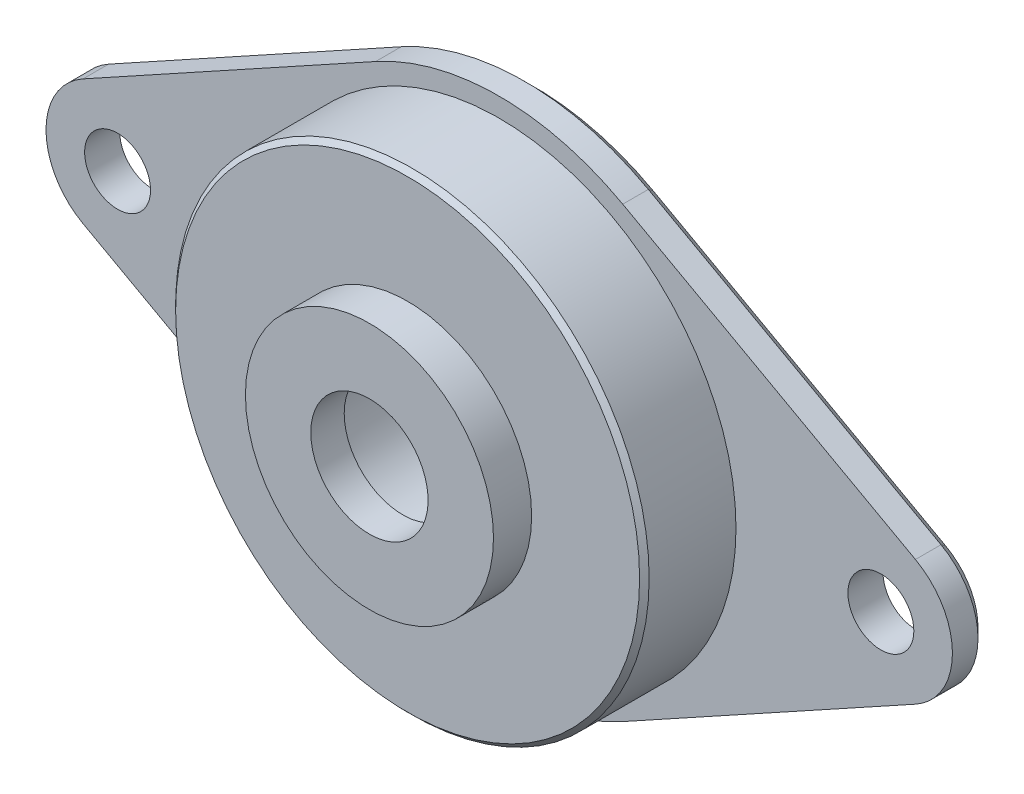
ISO-10303-21;
HEADER;
FILE_DESCRIPTION(('STEP AP214'),'2;1');
FILE_NAME('part.step','',(''),(''),'','','');
FILE_SCHEMA(('AUTOMOTIVE_DESIGN { 1 0 10303 214 1 1 1 1 }'));
ENDSEC;
DATA;
#1=APPLICATION_CONTEXT('core data for automotive mechanical design processes');
#2=APPLICATION_PROTOCOL_DEFINITION('international standard','automotive_design',2000,#1);
#3=PRODUCT_CONTEXT('',#1,'mechanical');
#4=PRODUCT('Part','Part','',(#3));
#5=PRODUCT_RELATED_PRODUCT_CATEGORY('part','',(#4));
#6=PRODUCT_DEFINITION_FORMATION('','',#4);
#7=PRODUCT_DEFINITION_CONTEXT('part definition',#1,'design');
#8=PRODUCT_DEFINITION('design','',#6,#7);
#9=PRODUCT_DEFINITION_SHAPE('','',#8);
#10=(LENGTH_UNIT() NAMED_UNIT(*) SI_UNIT(.MILLI.,.METRE.));
#11=(NAMED_UNIT(*) PLANE_ANGLE_UNIT() SI_UNIT($,.RADIAN.));
#12=(NAMED_UNIT(*) SI_UNIT($,.STERADIAN.) SOLID_ANGLE_UNIT());
#13=UNCERTAINTY_MEASURE_WITH_UNIT(LENGTH_MEASURE(1.E-05),#10,'distance_accuracy_value','');
#14=(GEOMETRIC_REPRESENTATION_CONTEXT(3) GLOBAL_UNCERTAINTY_ASSIGNED_CONTEXT((#13)) GLOBAL_UNIT_ASSIGNED_CONTEXT((#10,
#11,#12)) REPRESENTATION_CONTEXT('',''));
#15=CARTESIAN_POINT('',(0.,0.,0.));
#16=DIRECTION('',(0.,0.,1.));
#17=DIRECTION('',(1.,0.,0.));
#18=AXIS2_PLACEMENT_3D('',#15,#16,#17);
#19=CARTESIAN_POINT('',(0.,0.,0.));
#20=DIRECTION('',(0.,0.,1.));
#21=DIRECTION('',(1.,0.,0.));
#22=AXIS2_PLACEMENT_3D('',#19,#20,#21);
#23=CYLINDRICAL_SURFACE('',#22,13.4079);
#24=DIRECTION('',(0.,0.,-1.));
#25=VECTOR('',#24,1.);
#26=CARTESIAN_POINT('',(-6.4746078705,-11.7410065724051,24.35208593842));
#27=LINE('',#26,#25);
#28=CARTESIAN_POINT('',(-6.4746078705,-11.7410065724051,-4.8));
#29=VERTEX_POINT('',#28);
#30=CARTESIAN_POINT('',(-6.4746078705,-11.7410065724051,-6.14));
#31=VERTEX_POINT('',#30);
#32=EDGE_CURVE('E126',#29,#31,#27,.T.);
#33=ORIENTED_EDGE('',*,*,#32,.T.);
#34=CARTESIAN_POINT('',(0.,0.,-6.14));
#35=DIRECTION('',(0.,0.,-1.));
#36=DIRECTION('',(-1.,0.,0.));
#37=AXIS2_PLACEMENT_3D('',#34,#35,#36);
#38=CIRCLE('',#37,13.4079);
#39=CARTESIAN_POINT('',(6.4746078705,-11.7410065724051,-6.14));
#40=VERTEX_POINT('',#39);
#41=EDGE_CURVE('E41',#31,#40,#38,.F.);
#42=ORIENTED_EDGE('',*,*,#41,.T.);
#43=DIRECTION('',(0.,0.,-1.));
#44=VECTOR('',#43,1.);
#45=CARTESIAN_POINT('',(6.4746078705,-11.7410065724051,24.35208593842));
#46=LINE('',#45,#44);
#47=CARTESIAN_POINT('',(6.4746078705,-11.7410065724051,-4.8));
#48=VERTEX_POINT('',#47);
#49=EDGE_CURVE('E162',#48,#40,#46,.T.);
#50=ORIENTED_EDGE('',*,*,#49,.F.);
#51=CARTESIAN_POINT('',(0.,0.,-4.8));
#52=DIRECTION('',(0.,0.,1.));
#53=DIRECTION('',(1.,0.,0.));
#54=AXIS2_PLACEMENT_3D('',#51,#52,#53);
#55=CIRCLE('',#54,13.4079);
#56=EDGE_CURVE('E183',#29,#48,#55,.T.);
#57=ORIENTED_EDGE('',*,*,#56,.F.);
#58=EDGE_LOOP('',(#33,#42,#50,#57));
#59=FACE_BOUND('',#58,.T.);
#60=ADVANCED_FACE('F32',(#59),#23,.T.);
#61=CARTESIAN_POINT('',(0.,0.,0.));
#62=DIRECTION('',(0.,0.,1.));
#63=DIRECTION('',(1.,0.,0.));
#64=AXIS2_PLACEMENT_3D('',#61,#62,#63);
#65=PLANE('',#64);
#66=CARTESIAN_POINT('',(0.,0.,0.));
#67=DIRECTION('',(0.,0.,1.));
#68=DIRECTION('',(1.,0.,0.));
#69=AXIS2_PLACEMENT_3D('',#66,#67,#68);
#70=CIRCLE('',#69,12.1579);
#71=CARTESIAN_POINT('',(12.1579,0.,0.));
#72=VERTEX_POINT('',#71);
#73=EDGE_CURVE('E191',#72,#72,#70,.T.);
#74=ORIENTED_EDGE('',*,*,#73,.T.);
#75=EDGE_LOOP('',(#74));
#76=FACE_BOUND('',#75,.T.);
#77=CARTESIAN_POINT('',(0.,0.,0.));
#78=DIRECTION('',(0.,0.,1.));
#79=DIRECTION('',(1.,0.,0.));
#80=AXIS2_PLACEMENT_3D('',#77,#78,#79);
#81=CIRCLE('',#80,6.5);
#82=CARTESIAN_POINT('',(6.5,0.,0.));
#83=VERTEX_POINT('',#82);
#84=EDGE_CURVE('E179',#83,#83,#81,.T.);
#85=ORIENTED_EDGE('',*,*,#84,.F.);
#86=EDGE_LOOP('',(#85));
#87=FACE_BOUND('',#86,.T.);
#88=ADVANCED_FACE('F309',(#76,#87),#65,.T.);
#89=CARTESIAN_POINT('',(0.,0.,0.));
#90=DIRECTION('',(0.,0.,1.));
#91=DIRECTION('',(1.,0.,0.));
#92=AXIS2_PLACEMENT_3D('',#89,#90,#91);
#93=CYLINDRICAL_SURFACE('',#92,12.4079);
#94=CARTESIAN_POINT('',(0.,0.,-0.25));
#95=DIRECTION('',(0.,0.,1.));
#96=DIRECTION('',(1.,0.,0.));
#97=AXIS2_PLACEMENT_3D('',#94,#95,#96);
#98=CIRCLE('',#97,12.4079);
#99=CARTESIAN_POINT('',(12.4079,0.,-0.25));
#100=VERTEX_POINT('',#99);
#101=EDGE_CURVE('E196',#100,#100,#98,.F.);
#102=ORIENTED_EDGE('',*,*,#101,.T.);
#103=EDGE_LOOP('',(#102));
#104=FACE_BOUND('',#103,.T.);
#105=CARTESIAN_POINT('',(0.,0.,-4.8));
#106=DIRECTION('',(0.,0.,1.));
#107=DIRECTION('',(1.,0.,0.));
#108=AXIS2_PLACEMENT_3D('',#105,#106,#107);
#109=CIRCLE('',#108,12.4079);
#110=CARTESIAN_POINT('',(12.4079,0.,-4.8));
#111=VERTEX_POINT('',#110);
#112=EDGE_CURVE('E188',#111,#111,#109,.T.);
#113=ORIENTED_EDGE('',*,*,#112,.T.);
#114=EDGE_LOOP('',(#113));
#115=FACE_BOUND('',#114,.T.);
#116=ADVANCED_FACE('F282',(#104,#115),#93,.T.);
#117=CARTESIAN_POINT('',(13.4079,0.,-4.8));
#118=DIRECTION('',(0.,0.,1.));
#119=DIRECTION('',(1.,0.,0.));
#120=AXIS2_PLACEMENT_3D('',#117,#118,#119);
#121=PLANE('',#120);
#122=CARTESIAN_POINT('',(-20.,0.,-4.8));
#123=DIRECTION('',(0.,0.,1.));
#124=DIRECTION('',(1.,0.,0.));
#125=AXIS2_PLACEMENT_3D('',#122,#123,#124);
#126=CIRCLE('',#125,1.7272);
#127=CARTESIAN_POINT('',(-18.2728,0.,-4.8));
#128=VERTEX_POINT('',#127);
#129=EDGE_CURVE('E155',#128,#128,#126,.T.);
#130=ORIENTED_EDGE('',*,*,#129,.F.);
#131=EDGE_LOOP('',(#130));
#132=FACE_BOUND('',#131,.T.);
#133=CARTESIAN_POINT('',(20.,0.,-4.8));
#134=DIRECTION('',(0.,0.,1.));
#135=DIRECTION('',(1.,0.,0.));
#136=AXIS2_PLACEMENT_3D('',#133,#134,#135);
#137=CIRCLE('',#136,1.7272);
#138=CARTESIAN_POINT('',(21.7272,0.,-4.8));
#139=VERTEX_POINT('',#138);
#140=EDGE_CURVE('E158',#139,#139,#137,.T.);
#141=ORIENTED_EDGE('',*,*,#140,.F.);
#142=EDGE_LOOP('',(#141));
#143=FACE_BOUND('',#142,.T.);
#144=CARTESIAN_POINT('',(6.4746078705,11.7410065724051,-4.8));
#145=VERTEX_POINT('',#144);
#146=CARTESIAN_POINT('',(-6.4746078705,11.7410065724051,-4.8));
#147=VERTEX_POINT('',#146);
#148=EDGE_CURVE('E186',#145,#147,#55,.T.);
#149=ORIENTED_EDGE('',*,*,#148,.T.);
#150=DIRECTION('',(-0.875678262248755,-0.482895,0.));
#151=VECTOR('',#150,1.);
#152=CARTESIAN_POINT('',(-21.81085625,3.28379348343283,-4.8));
#153=LINE('',#152,#151);
#154=CARTESIAN_POINT('',(-21.81085625,3.28379348343283,-4.8));
#155=VERTEX_POINT('',#154);
#156=EDGE_CURVE('E145',#147,#155,#153,.T.);
#157=ORIENTED_EDGE('',*,*,#156,.T.);
#158=CARTESIAN_POINT('',(-20.,0.,-4.8));
#159=DIRECTION('',(0.,0.,1.));
#160=DIRECTION('',(1.,0.,0.));
#161=AXIS2_PLACEMENT_3D('',#158,#159,#160);
#162=CIRCLE('',#161,3.75);
#163=CARTESIAN_POINT('',(-21.81085625,-3.28379348343284,-4.8));
#164=VERTEX_POINT('',#163);
#165=EDGE_CURVE('E130',#155,#164,#162,.T.);
#166=ORIENTED_EDGE('',*,*,#165,.T.);
#167=DIRECTION('',(0.875678262248756,-0.482895,0.));
#168=VECTOR('',#167,1.);
#169=CARTESIAN_POINT('',(-21.81085625,-3.28379348343284,-4.8));
#170=LINE('',#169,#168);
#171=EDGE_CURVE('E122',#164,#29,#170,.T.);
#172=ORIENTED_EDGE('',*,*,#171,.T.);
#173=ORIENTED_EDGE('',*,*,#56,.T.);
#174=DIRECTION('',(-0.875678262248756,-0.482895,0.));
#175=VECTOR('',#174,1.);
#176=CARTESIAN_POINT('',(21.81085625,-3.28379348343284,-4.8));
#177=LINE('',#176,#175);
#178=CARTESIAN_POINT('',(21.81085625,-3.28379348343283,-4.8));
#179=VERTEX_POINT('',#178);
#180=EDGE_CURVE('E159',#179,#48,#177,.T.);
#181=ORIENTED_EDGE('',*,*,#180,.F.);
#182=CARTESIAN_POINT('',(20.,0.,-4.8));
#183=DIRECTION('',(0.,0.,1.));
#184=DIRECTION('',(1.,0.,0.));
#185=AXIS2_PLACEMENT_3D('',#182,#183,#184);
#186=CIRCLE('',#185,3.75);
#187=CARTESIAN_POINT('',(21.81085625,3.28379348343283,-4.8));
#188=VERTEX_POINT('',#187);
#189=EDGE_CURVE('E163',#188,#179,#186,.F.);
#190=ORIENTED_EDGE('',*,*,#189,.F.);
#191=DIRECTION('',(0.875678262248755,-0.482895,0.));
#192=VECTOR('',#191,1.);
#193=CARTESIAN_POINT('',(21.81085625,3.28379348343283,-4.8));
#194=LINE('',#193,#192);
#195=EDGE_CURVE('E168',#145,#188,#194,.T.);
#196=ORIENTED_EDGE('',*,*,#195,.F.);
#197=EDGE_LOOP('',(#149,#157,#166,#172,#173,#181,#190,#196));
#198=FACE_BOUND('',#197,.T.);
#199=ORIENTED_EDGE('',*,*,#112,.F.);
#200=EDGE_LOOP('',(#199));
#201=FACE_BOUND('',#200,.T.);
#202=ADVANCED_FACE('F142',(#132,#143,#198,#201),#121,.T.);
#203=DIRECTION('',(0.,0.,-1.));
#204=VECTOR('',#203,1.);
#205=CARTESIAN_POINT('',(6.4746078705,11.7410065724051,24.35208593842));
#206=LINE('',#205,#204);
#207=CARTESIAN_POINT('',(6.4746078705,11.7410065724051,-6.14));
#208=VERTEX_POINT('',#207);
#209=EDGE_CURVE('E171',#145,#208,#206,.T.);
#210=ORIENTED_EDGE('',*,*,#209,.T.);
#211=CARTESIAN_POINT('',(0.,0.,-6.14));
#212=DIRECTION('',(0.,0.,-1.));
#213=DIRECTION('',(-1.,0.,0.));
#214=AXIS2_PLACEMENT_3D('',#211,#212,#213);
#215=CIRCLE('',#214,13.4079);
#216=CARTESIAN_POINT('',(-6.4746078705,11.7410065724051,-6.14));
#217=VERTEX_POINT('',#216);
#218=EDGE_CURVE('E199',#208,#217,#215,.F.);
#219=ORIENTED_EDGE('',*,*,#218,.T.);
#220=DIRECTION('',(0.,0.,-1.));
#221=VECTOR('',#220,1.);
#222=CARTESIAN_POINT('',(-6.4746078705,11.7410065724051,24.35208593842));
#223=LINE('',#222,#221);
#224=EDGE_CURVE('E147',#147,#217,#223,.T.);
#225=ORIENTED_EDGE('',*,*,#224,.F.);
#226=ORIENTED_EDGE('',*,*,#148,.F.);
#227=EDGE_LOOP('',(#210,#219,#225,#226));
#228=FACE_BOUND('',#227,.T.);
#229=ADVANCED_FACE('F281',(#228),#23,.T.);
#230=CARTESIAN_POINT('',(13.4079,0.,-6.64));
#231=DIRECTION('',(0.,0.,-1.));
#232=DIRECTION('',(-1.,0.,0.));
#233=AXIS2_PLACEMENT_3D('',#230,#231,#232);
#234=PLANE('',#233);
#235=DIRECTION('',(0.875678262248755,0.482895,0.));
#236=VECTOR('',#235,1.);
#237=CARTESIAN_POINT('',(-6.2331603705,11.3031674412807,-6.64));
#238=LINE('',#237,#236);
#239=CARTESIAN_POINT('',(-21.56940875,2.84595435230845,-6.64));
#240=VERTEX_POINT('',#239);
#241=CARTESIAN_POINT('',(-6.2331603705,11.3031674412807,-6.64));
#242=VERTEX_POINT('',#241);
#243=EDGE_CURVE('E212',#240,#242,#238,.T.);
#244=ORIENTED_EDGE('',*,*,#243,.T.);
#245=CARTESIAN_POINT('',(0.,0.,-6.64));
#246=DIRECTION('',(0.,0.,-1.));
#247=DIRECTION('',(-1.,0.,0.));
#248=AXIS2_PLACEMENT_3D('',#245,#246,#247);
#249=CIRCLE('',#248,12.9079);
#250=CARTESIAN_POINT('',(6.2331603705,11.3031674412807,-6.64));
#251=VERTEX_POINT('',#250);
#252=EDGE_CURVE('E216',#242,#251,#249,.T.);
#253=ORIENTED_EDGE('',*,*,#252,.T.);
#254=DIRECTION('',(0.875678262248755,-0.482895,0.));
#255=VECTOR('',#254,1.);
#256=CARTESIAN_POINT('',(16.5145046028749,5.63349407249915,-6.64));
#257=LINE('',#256,#255);
#258=CARTESIAN_POINT('',(21.56940875,2.84595435230845,-6.64));
#259=VERTEX_POINT('',#258);
#260=EDGE_CURVE('E214',#251,#259,#257,.T.);
#261=ORIENTED_EDGE('',*,*,#260,.T.);
#262=CARTESIAN_POINT('',(20.,0.,-6.64));
#263=DIRECTION('',(0.,0.,-1.));
#264=DIRECTION('',(-1.,0.,0.));
#265=AXIS2_PLACEMENT_3D('',#262,#263,#264);
#266=CIRCLE('',#265,3.25);
#267=CARTESIAN_POINT('',(21.56940875,-2.84595435230846,-6.64));
#268=VERTEX_POINT('',#267);
#269=EDGE_CURVE('E210',#259,#268,#266,.T.);
#270=ORIENTED_EDGE('',*,*,#269,.T.);
#271=DIRECTION('',(-0.875678262248756,-0.482895,0.));
#272=VECTOR('',#271,1.);
#273=CARTESIAN_POINT('',(16.5145046028749,-5.63349407249915,-6.64));
#274=LINE('',#273,#272);
#275=CARTESIAN_POINT('',(6.23316037049999,-11.3031674412807,-6.64));
#276=VERTEX_POINT('',#275);
#277=EDGE_CURVE('E202',#268,#276,#274,.T.);
#278=ORIENTED_EDGE('',*,*,#277,.T.);
#279=CARTESIAN_POINT('',(0.,0.,-6.64));
#280=DIRECTION('',(0.,0.,-1.));
#281=DIRECTION('',(-1.,0.,0.));
#282=AXIS2_PLACEMENT_3D('',#279,#280,#281);
#283=CIRCLE('',#282,12.9079);
#284=CARTESIAN_POINT('',(-6.2331603705,-11.3031674412807,-6.64));
#285=VERTEX_POINT('',#284);
#286=EDGE_CURVE('E204',#276,#285,#283,.T.);
#287=ORIENTED_EDGE('',*,*,#286,.T.);
#288=DIRECTION('',(-0.875678262248756,0.482895,0.));
#289=VECTOR('',#288,1.);
#290=CARTESIAN_POINT('',(-21.56940875,-2.84595435230845,-6.64));
#291=LINE('',#290,#289);
#292=CARTESIAN_POINT('',(-21.56940875,-2.84595435230846,-6.64));
#293=VERTEX_POINT('',#292);
#294=EDGE_CURVE('E206',#285,#293,#291,.T.);
#295=ORIENTED_EDGE('',*,*,#294,.T.);
#296=CARTESIAN_POINT('',(-20.,0.,-6.64));
#297=DIRECTION('',(0.,0.,-1.));
#298=DIRECTION('',(-1.,0.,0.));
#299=AXIS2_PLACEMENT_3D('',#296,#297,#298);
#300=CIRCLE('',#299,3.25);
#301=EDGE_CURVE('E208',#293,#240,#300,.T.);
#302=ORIENTED_EDGE('',*,*,#301,.T.);
#303=EDGE_LOOP('',(#244,#253,#261,#270,#278,#287,#295,#302));
#304=FACE_BOUND('',#303,.T.);
#305=CARTESIAN_POINT('',(0.,0.,-6.64));
#306=DIRECTION('',(0.,0.,-1.));
#307=DIRECTION('',(-1.,0.,0.));
#308=AXIS2_PLACEMENT_3D('',#305,#306,#307);
#309=CIRCLE('',#308,4.603877);
#310=CARTESIAN_POINT('',(-4.603877,0.,-6.64));
#311=VERTEX_POINT('',#310);
#312=EDGE_CURVE('E249',#311,#311,#309,.T.);
#313=ORIENTED_EDGE('',*,*,#312,.F.);
#314=EDGE_LOOP('',(#313));
#315=FACE_BOUND('',#314,.T.);
#316=CARTESIAN_POINT('',(-20.,0.,-6.64));
#317=DIRECTION('',(0.,0.,-1.));
#318=DIRECTION('',(-1.,0.,0.));
#319=AXIS2_PLACEMENT_3D('',#316,#317,#318);
#320=CIRCLE('',#319,1.7272);
#321=CARTESIAN_POINT('',(-21.7272,0.,-6.64));
#322=VERTEX_POINT('',#321);
#323=EDGE_CURVE('E271',#322,#322,#320,.T.);
#324=ORIENTED_EDGE('',*,*,#323,.F.);
#325=EDGE_LOOP('',(#324));
#326=FACE_BOUND('',#325,.T.);
#327=CARTESIAN_POINT('',(20.,0.,-6.64));
#328=DIRECTION('',(0.,0.,-1.));
#329=DIRECTION('',(-1.,0.,0.));
#330=AXIS2_PLACEMENT_3D('',#327,#328,#329);
#331=CIRCLE('',#330,1.7272);
#332=CARTESIAN_POINT('',(18.2728,0.,-6.64));
#333=VERTEX_POINT('',#332);
#334=EDGE_CURVE('E129',#333,#333,#331,.T.);
#335=ORIENTED_EDGE('',*,*,#334,.F.);
#336=EDGE_LOOP('',(#335));
#337=FACE_BOUND('',#336,.T.);
#338=ADVANCED_FACE('F293',(#304,#315,#326,#337),#234,.T.);
#339=CARTESIAN_POINT('',(0.,0.,2.));
#340=DIRECTION('',(0.,0.,-1.));
#341=DIRECTION('',(-1.,0.,0.));
#342=AXIS2_PLACEMENT_3D('',#339,#340,#341);
#343=CYLINDRICAL_SURFACE('',#342,6.5);
#344=CARTESIAN_POINT('',(0.,0.,2.));
#345=DIRECTION('',(0.,0.,1.));
#346=DIRECTION('',(1.,0.,0.));
#347=AXIS2_PLACEMENT_3D('',#344,#345,#346);
#348=CIRCLE('',#347,6.5);
#349=CARTESIAN_POINT('',(6.5,0.,2.));
#350=VERTEX_POINT('',#349);
#351=EDGE_CURVE('E180',#350,#350,#348,.T.);
#352=ORIENTED_EDGE('',*,*,#351,.F.);
#353=EDGE_LOOP('',(#352));
#354=FACE_BOUND('',#353,.T.);
#355=ORIENTED_EDGE('',*,*,#84,.T.);
#356=EDGE_LOOP('',(#355));
#357=FACE_BOUND('',#356,.T.);
#358=ADVANCED_FACE('F295',(#354,#357),#343,.T.);
#359=CARTESIAN_POINT('',(0.,0.,2.));
#360=DIRECTION('',(0.,0.,1.));
#361=DIRECTION('',(1.,0.,0.));
#362=AXIS2_PLACEMENT_3D('',#359,#360,#361);
#363=PLANE('',#362);
#364=CARTESIAN_POINT('',(0.,0.,2.));
#365=DIRECTION('',(0.,0.,-1.));
#366=DIRECTION('',(-1.,0.,0.));
#367=AXIS2_PLACEMENT_3D('',#364,#365,#366);
#368=CIRCLE('',#367,3.0734);
#369=CARTESIAN_POINT('',(-3.0734,0.,2.));
#370=VERTEX_POINT('',#369);
#371=EDGE_CURVE('E268',#370,#370,#368,.T.);
#372=ORIENTED_EDGE('',*,*,#371,.T.);
#373=EDGE_LOOP('',(#372));
#374=FACE_BOUND('',#373,.T.);
#375=ORIENTED_EDGE('',*,*,#351,.T.);
#376=EDGE_LOOP('',(#375));
#377=FACE_BOUND('',#376,.T.);
#378=ADVANCED_FACE('F302',(#374,#377),#363,.T.);
#379=CARTESIAN_POINT('',(21.81085625,-3.28379348343284,24.35208593842));
#380=DIRECTION('',(0.482895,-0.875678262248756,0.));
#381=DIRECTION('',(0.875678262248756,0.482895,0.));
#382=AXIS2_PLACEMENT_3D('',#379,#380,#381);
#383=PLANE('',#382);
#384=ORIENTED_EDGE('',*,*,#49,.T.);
#385=DIRECTION('',(0.875678262248756,0.482895,0.));
#386=VECTOR('',#385,1.);
#387=CARTESIAN_POINT('',(21.81085625,-3.28379348343284,-6.14));
#388=LINE('',#387,#386);
#389=CARTESIAN_POINT('',(21.81085625,-3.28379348343284,-6.14));
#390=VERTEX_POINT('',#389);
#391=EDGE_CURVE('E11',#40,#390,#388,.T.);
#392=ORIENTED_EDGE('',*,*,#391,.T.);
#393=DIRECTION('',(0.,0.,-1.));
#394=VECTOR('',#393,1.);
#395=CARTESIAN_POINT('',(21.81085625,-3.28379348343284,24.35208593842));
#396=LINE('',#395,#394);
#397=EDGE_CURVE('E166',#179,#390,#396,.T.);
#398=ORIENTED_EDGE('',*,*,#397,.F.);
#399=ORIENTED_EDGE('',*,*,#180,.T.);
#400=EDGE_LOOP('',(#384,#392,#398,#399));
#401=FACE_BOUND('',#400,.T.);
#402=ADVANCED_FACE('F371',(#401),#383,.T.);
#403=CARTESIAN_POINT('',(21.81085625,3.28379348343283,24.35208593842));
#404=DIRECTION('',(0.482895,0.875678262248755,0.));
#405=DIRECTION('',(-0.875678262248755,0.482895,0.));
#406=AXIS2_PLACEMENT_3D('',#403,#404,#405);
#407=PLANE('',#406);
#408=DIRECTION('',(0.,0.,-1.));
#409=VECTOR('',#408,1.);
#410=CARTESIAN_POINT('',(21.81085625,3.28379348343283,24.35208593842));
#411=LINE('',#410,#409);
#412=CARTESIAN_POINT('',(21.81085625,3.28379348343283,-6.14));
#413=VERTEX_POINT('',#412);
#414=EDGE_CURVE('E167',#188,#413,#411,.T.);
#415=ORIENTED_EDGE('',*,*,#414,.T.);
#416=DIRECTION('',(-0.875678262248755,0.482895,0.));
#417=VECTOR('',#416,1.);
#418=CARTESIAN_POINT('',(21.81085625,3.28379348343283,-6.14));
#419=LINE('',#418,#417);
#420=EDGE_CURVE('E219',#413,#208,#419,.T.);
#421=ORIENTED_EDGE('',*,*,#420,.T.);
#422=ORIENTED_EDGE('',*,*,#209,.F.);
#423=ORIENTED_EDGE('',*,*,#195,.T.);
#424=EDGE_LOOP('',(#415,#421,#422,#423));
#425=FACE_BOUND('',#424,.T.);
#426=ADVANCED_FACE('F367',(#425),#407,.T.);
#427=CARTESIAN_POINT('',(20.,0.,24.35208593842));
#428=DIRECTION('',(0.,0.,-1.));
#429=DIRECTION('',(-1.,0.,0.));
#430=AXIS2_PLACEMENT_3D('',#427,#428,#429);
#431=CYLINDRICAL_SURFACE('',#430,3.75);
#432=ORIENTED_EDGE('',*,*,#397,.T.);
#433=CARTESIAN_POINT('',(20.,0.,-6.14));
#434=DIRECTION('',(0.,0.,-1.));
#435=DIRECTION('',(-1.,0.,0.));
#436=AXIS2_PLACEMENT_3D('',#433,#434,#435);
#437=CIRCLE('',#436,3.75);
#438=EDGE_CURVE('E223',#390,#413,#437,.F.);
#439=ORIENTED_EDGE('',*,*,#438,.T.);
#440=ORIENTED_EDGE('',*,*,#414,.F.);
#441=ORIENTED_EDGE('',*,*,#189,.T.);
#442=EDGE_LOOP('',(#432,#439,#440,#441));
#443=FACE_BOUND('',#442,.T.);
#444=ADVANCED_FACE('F289',(#443),#431,.T.);
#445=CARTESIAN_POINT('',(20.,0.,-6.64));
#446=DIRECTION('',(0.,0.,-1.));
#447=DIRECTION('',(-1.,0.,0.));
#448=AXIS2_PLACEMENT_3D('',#445,#446,#447);
#449=CYLINDRICAL_SURFACE('',#448,1.7272);
#450=ORIENTED_EDGE('',*,*,#140,.T.);
#451=EDGE_LOOP('',(#450));
#452=FACE_BOUND('',#451,.T.);
#453=ORIENTED_EDGE('',*,*,#334,.T.);
#454=EDGE_LOOP('',(#453));
#455=FACE_BOUND('',#454,.T.);
#456=ADVANCED_FACE('F286',(#452,#455),#449,.F.);
#457=CARTESIAN_POINT('',(-20.,0.,24.35208593842));
#458=DIRECTION('',(0.,0.,-1.));
#459=DIRECTION('',(-1.,0.,0.));
#460=AXIS2_PLACEMENT_3D('',#457,#458,#459);
#461=CYLINDRICAL_SURFACE('',#460,3.75);
#462=DIRECTION('',(0.,0.,-1.));
#463=VECTOR('',#462,1.);
#464=CARTESIAN_POINT('',(-21.81085625,3.28379348343283,24.35208593842));
#465=LINE('',#464,#463);
#466=CARTESIAN_POINT('',(-21.81085625,3.28379348343283,-6.14));
#467=VERTEX_POINT('',#466);
#468=EDGE_CURVE('E139',#155,#467,#465,.T.);
#469=ORIENTED_EDGE('',*,*,#468,.T.);
#470=CARTESIAN_POINT('',(-20.,0.,-6.14));
#471=DIRECTION('',(0.,0.,-1.));
#472=DIRECTION('',(-1.,0.,0.));
#473=AXIS2_PLACEMENT_3D('',#470,#471,#472);
#474=CIRCLE('',#473,3.75);
#475=CARTESIAN_POINT('',(-21.81085625,-3.28379348343284,-6.14));
#476=VERTEX_POINT('',#475);
#477=EDGE_CURVE('E138',#467,#476,#474,.F.);
#478=ORIENTED_EDGE('',*,*,#477,.T.);
#479=DIRECTION('',(0.,0.,-1.));
#480=VECTOR('',#479,1.);
#481=CARTESIAN_POINT('',(-21.81085625,-3.28379348343284,24.35208593842));
#482=LINE('',#481,#480);
#483=EDGE_CURVE('E125',#164,#476,#482,.T.);
#484=ORIENTED_EDGE('',*,*,#483,.F.);
#485=ORIENTED_EDGE('',*,*,#165,.F.);
#486=EDGE_LOOP('',(#469,#478,#484,#485));
#487=FACE_BOUND('',#486,.T.);
#488=ADVANCED_FACE('F135',(#487),#461,.T.);
#489=CARTESIAN_POINT('',(-21.81085625,-3.28379348343284,24.35208593842));
#490=DIRECTION('',(0.482895,0.875678262248756,0.));
#491=DIRECTION('',(-0.875678262248756,0.482895,0.));
#492=AXIS2_PLACEMENT_3D('',#489,#490,#491);
#493=PLANE('',#492);
#494=ORIENTED_EDGE('',*,*,#483,.T.);
#495=DIRECTION('',(0.875678262248756,-0.482895,0.));
#496=VECTOR('',#495,1.);
#497=CARTESIAN_POINT('',(-6.4746078705,-11.7410065724051,-6.14));
#498=LINE('',#497,#496);
#499=EDGE_CURVE('E56',#476,#31,#498,.T.);
#500=ORIENTED_EDGE('',*,*,#499,.T.);
#501=ORIENTED_EDGE('',*,*,#32,.F.);
#502=ORIENTED_EDGE('',*,*,#171,.F.);
#503=EDGE_LOOP('',(#494,#500,#501,#502));
#504=FACE_BOUND('',#503,.T.);
#505=ADVANCED_FACE('F124',(#504),#493,.F.);
#506=CARTESIAN_POINT('',(-21.81085625,3.28379348343283,24.35208593842));
#507=DIRECTION('',(0.482895,-0.875678262248755,0.));
#508=DIRECTION('',(0.875678262248755,0.482895,0.));
#509=AXIS2_PLACEMENT_3D('',#506,#507,#508);
#510=PLANE('',#509);
#511=ORIENTED_EDGE('',*,*,#224,.T.);
#512=DIRECTION('',(-0.875678262248755,-0.482895,0.));
#513=VECTOR('',#512,1.);
#514=CARTESIAN_POINT('',(-21.81085625,3.28379348343283,-6.14));
#515=LINE('',#514,#513);
#516=EDGE_CURVE('E221',#217,#467,#515,.T.);
#517=ORIENTED_EDGE('',*,*,#516,.T.);
#518=ORIENTED_EDGE('',*,*,#468,.F.);
#519=ORIENTED_EDGE('',*,*,#156,.F.);
#520=EDGE_LOOP('',(#511,#517,#518,#519));
#521=FACE_BOUND('',#520,.T.);
#522=ADVANCED_FACE('F388',(#521),#510,.F.);
#523=CARTESIAN_POINT('',(-20.,0.,-6.64));
#524=DIRECTION('',(0.,0.,-1.));
#525=DIRECTION('',(-1.,0.,0.));
#526=AXIS2_PLACEMENT_3D('',#523,#524,#525);
#527=CYLINDRICAL_SURFACE('',#526,1.7272);
#528=ORIENTED_EDGE('',*,*,#129,.T.);
#529=EDGE_LOOP('',(#528));
#530=FACE_BOUND('',#529,.T.);
#531=ORIENTED_EDGE('',*,*,#323,.T.);
#532=EDGE_LOOP('',(#531));
#533=FACE_BOUND('',#532,.T.);
#534=ADVANCED_FACE('F276',(#530,#533),#527,.F.);
#535=CARTESIAN_POINT('',(0.,0.,-6.64));
#536=DIRECTION('',(0.,0.,-1.));
#537=DIRECTION('',(-1.,0.,0.));
#538=AXIS2_PLACEMENT_3D('',#535,#536,#537);
#539=CYLINDRICAL_SURFACE('',#538,3.07340000000001);
#540=ORIENTED_EDGE('',*,*,#371,.F.);
#541=EDGE_LOOP('',(#540));
#542=FACE_BOUND('',#541,.T.);
#543=CARTESIAN_POINT('',(0.,0.,0.249999999999998));
#544=DIRECTION('',(0.,0.,-1.));
#545=DIRECTION('',(-1.,0.,0.));
#546=AXIS2_PLACEMENT_3D('',#543,#544,#545);
#547=CIRCLE('',#546,3.07340000000001);
#548=CARTESIAN_POINT('',(-3.07340000000001,0.,0.249999999999998));
#549=VERTEX_POINT('',#548);
#550=EDGE_CURVE('E265',#549,#549,#547,.T.);
#551=ORIENTED_EDGE('',*,*,#550,.T.);
#552=EDGE_LOOP('',(#551));
#553=FACE_BOUND('',#552,.T.);
#554=ADVANCED_FACE('F394',(#542,#553),#539,.F.);
#555=CARTESIAN_POINT('',(3.07340000000001,0.,0.249999999999998));
#556=DIRECTION('',(0.,0.,1.));
#557=DIRECTION('',(1.,0.,0.));
#558=AXIS2_PLACEMENT_3D('',#555,#556,#557);
#559=PLANE('',#558);
#560=ORIENTED_EDGE('',*,*,#550,.F.);
#561=EDGE_LOOP('',(#560));
#562=FACE_BOUND('',#561,.T.);
#563=CARTESIAN_POINT('',(0.,0.,0.249999999999998));
#564=DIRECTION('',(0.,0.,-1.));
#565=DIRECTION('',(-1.,0.,0.));
#566=AXIS2_PLACEMENT_3D('',#563,#564,#565);
#567=CIRCLE('',#566,3.78159392348833);
#568=CARTESIAN_POINT('',(-3.78159392348833,0.,0.249999999999998));
#569=VERTEX_POINT('',#568);
#570=EDGE_CURVE('E260',#569,#569,#567,.T.);
#571=ORIENTED_EDGE('',*,*,#570,.T.);
#572=EDGE_LOOP('',(#571));
#573=FACE_BOUND('',#572,.T.);
#574=ADVANCED_FACE('F397',(#562,#573),#559,.F.);
#575=CARTESIAN_POINT('',(0.,0.,-6.005));
#576=DIRECTION('',(0.,0.,-1.));
#577=DIRECTION('',(-1.,0.,0.));
#578=AXIS2_PLACEMENT_3D('',#575,#576,#577);
#579=CONICAL_SURFACE('',#578,3.968877,0.0299323966717027);
#580=ORIENTED_EDGE('',*,*,#570,.F.);
#581=EDGE_LOOP('',(#580));
#582=FACE_BOUND('',#581,.T.);
#583=CARTESIAN_POINT('',(0.,0.,-6.005));
#584=DIRECTION('',(0.,0.,-1.));
#585=DIRECTION('',(-1.,0.,0.));
#586=AXIS2_PLACEMENT_3D('',#583,#584,#585);
#587=CIRCLE('',#586,3.968877);
#588=CARTESIAN_POINT('',(-3.968877,0.,-6.005));
#589=VERTEX_POINT('',#588);
#590=EDGE_CURVE('E255',#589,#589,#587,.T.);
#591=ORIENTED_EDGE('',*,*,#590,.T.);
#592=EDGE_LOOP('',(#591));
#593=FACE_BOUND('',#592,.T.);
#594=ADVANCED_FACE('F401',(#582,#593),#579,.F.);
#595=CARTESIAN_POINT('',(0.,0.,-6.64));
#596=DIRECTION('',(0.,0.,-1.));
#597=DIRECTION('',(-1.,0.,0.));
#598=AXIS2_PLACEMENT_3D('',#595,#596,#597);
#599=CONICAL_SURFACE('',#598,4.603877,0.785398163397447);
#600=ORIENTED_EDGE('',*,*,#590,.F.);
#601=EDGE_LOOP('',(#600));
#602=FACE_BOUND('',#601,.T.);
#603=ORIENTED_EDGE('',*,*,#312,.T.);
#604=EDGE_LOOP('',(#603));
#605=FACE_BOUND('',#604,.T.);
#606=ADVANCED_FACE('F322',(#602,#605),#599,.F.);
#607=CARTESIAN_POINT('',(0.,0.,0.));
#608=DIRECTION('',(0.,0.,-1.));
#609=DIRECTION('',(-1.,0.,0.));
#610=AXIS2_PLACEMENT_3D('',#607,#608,#609);
#611=CONICAL_SURFACE('',#610,12.1579,0.785398163397438);
#612=ORIENTED_EDGE('',*,*,#101,.F.);
#613=EDGE_LOOP('',(#612));
#614=FACE_BOUND('',#613,.T.);
#615=ORIENTED_EDGE('',*,*,#73,.F.);
#616=EDGE_LOOP('',(#615));
#617=FACE_BOUND('',#616,.T.);
#618=ADVANCED_FACE('F319',(#614,#617),#611,.T.);
#619=CARTESIAN_POINT('',(0.,0.,-6.14));
#620=DIRECTION('',(0.,0.,1.));
#621=DIRECTION('',(1.,0.,0.));
#622=AXIS2_PLACEMENT_3D('',#619,#620,#621);
#623=CONICAL_SURFACE('',#622,13.4079,0.785398163397447);
#624=DIRECTION('',(-0.341458329101076,-0.619198037373747,0.707106781186548));
#625=VECTOR('',#624,1.);
#626=CARTESIAN_POINT('',(-6.2331603705,-11.3031674412807,-6.64));
#627=LINE('',#626,#625);
#628=EDGE_CURVE('E243',#285,#31,#627,.T.);
#629=ORIENTED_EDGE('',*,*,#628,.F.);
#630=ORIENTED_EDGE('',*,*,#286,.F.);
#631=DIRECTION('',(-0.341458329101077,0.619198037373747,-0.707106781186548));
#632=VECTOR('',#631,1.);
#633=CARTESIAN_POINT('',(6.4746078705,-11.7410065724051,-6.14));
#634=LINE('',#633,#632);
#635=EDGE_CURVE('E36',#40,#276,#634,.T.);
#636=ORIENTED_EDGE('',*,*,#635,.F.);
#637=ORIENTED_EDGE('',*,*,#41,.F.);
#638=EDGE_LOOP('',(#629,#630,#636,#637));
#639=FACE_BOUND('',#638,.T.);
#640=ADVANCED_FACE('F34',(#639),#623,.T.);
#641=CARTESIAN_POINT('',(16.5145046028749,-5.63349407249915,-6.64));
#642=DIRECTION('',(-0.341458329101076,0.619198037373745,0.70710678118655));
#643=DIRECTION('',(0.,-0.752323760656716,0.658793563380317));
#644=AXIS2_PLACEMENT_3D('',#641,#642,#643);
#645=PLANE('',#644);
#646=ORIENTED_EDGE('',*,*,#635,.T.);
#647=ORIENTED_EDGE('',*,*,#277,.F.);
#648=DIRECTION('',(-0.34145832910108,0.619198037373747,-0.707106781186546));
#649=VECTOR('',#648,1.);
#650=CARTESIAN_POINT('',(21.81085625,-3.28379348343284,-6.14));
#651=LINE('',#650,#649);
#652=EDGE_CURVE('E241',#390,#268,#651,.T.);
#653=ORIENTED_EDGE('',*,*,#652,.F.);
#654=ORIENTED_EDGE('',*,*,#391,.F.);
#655=EDGE_LOOP('',(#646,#647,#653,#654));
#656=FACE_BOUND('',#655,.T.);
#657=ADVANCED_FACE('F346',(#656),#645,.F.);
#658=CARTESIAN_POINT('',(-21.81085625,-3.28379348343284,-6.14));
#659=DIRECTION('',(-0.341458329101076,-0.619198037373744,-0.707106781186551));
#660=DIRECTION('',(0.,0.752323760656717,-0.658793563380317));
#661=AXIS2_PLACEMENT_3D('',#658,#659,#660);
#662=PLANE('',#661);
#663=ORIENTED_EDGE('',*,*,#628,.T.);
#664=ORIENTED_EDGE('',*,*,#499,.F.);
#665=DIRECTION('',(-0.34145832910108,-0.619198037373748,0.707106781186545));
#666=VECTOR('',#665,1.);
#667=CARTESIAN_POINT('',(-21.56940875,-2.84595435230846,-6.64));
#668=LINE('',#667,#666);
#669=EDGE_CURVE('E238',#293,#476,#668,.T.);
#670=ORIENTED_EDGE('',*,*,#669,.F.);
#671=ORIENTED_EDGE('',*,*,#294,.F.);
#672=EDGE_LOOP('',(#663,#664,#670,#671));
#673=FACE_BOUND('',#672,.T.);
#674=ADVANCED_FACE('F343',(#673),#662,.T.);
#675=CARTESIAN_POINT('',(20.,0.,-6.64));
#676=DIRECTION('',(0.,0.,1.));
#677=DIRECTION('',(1.,0.,0.));
#678=AXIS2_PLACEMENT_3D('',#675,#676,#677);
#679=CONICAL_SURFACE('',#678,3.25,0.785398163397449);
#680=ORIENTED_EDGE('',*,*,#652,.T.);
#681=ORIENTED_EDGE('',*,*,#269,.F.);
#682=DIRECTION('',(-0.34145832910108,-0.619198037373747,-0.707106781186546));
#683=VECTOR('',#682,1.);
#684=CARTESIAN_POINT('',(21.81085625,3.28379348343283,-6.14));
#685=LINE('',#684,#683);
#686=EDGE_CURVE('E235',#413,#259,#685,.T.);
#687=ORIENTED_EDGE('',*,*,#686,.F.);
#688=ORIENTED_EDGE('',*,*,#438,.F.);
#689=EDGE_LOOP('',(#680,#681,#687,#688));
#690=FACE_BOUND('',#689,.T.);
#691=ADVANCED_FACE('F339',(#690),#679,.T.);
#692=CARTESIAN_POINT('',(-20.,0.,-6.14));
#693=DIRECTION('',(0.,0.,1.));
#694=DIRECTION('',(1.,0.,0.));
#695=AXIS2_PLACEMENT_3D('',#692,#693,#694);
#696=CONICAL_SURFACE('',#695,3.75,0.785398163397449);
#697=ORIENTED_EDGE('',*,*,#669,.T.);
#698=ORIENTED_EDGE('',*,*,#477,.F.);
#699=DIRECTION('',(-0.34145832910108,0.619198037373747,0.707106781186546));
#700=VECTOR('',#699,1.);
#701=CARTESIAN_POINT('',(-21.56940875,2.84595435230845,-6.64));
#702=LINE('',#701,#700);
#703=EDGE_CURVE('E232',#240,#467,#702,.T.);
#704=ORIENTED_EDGE('',*,*,#703,.F.);
#705=ORIENTED_EDGE('',*,*,#301,.F.);
#706=EDGE_LOOP('',(#697,#698,#704,#705));
#707=FACE_BOUND('',#706,.T.);
#708=ADVANCED_FACE('F335',(#707),#696,.T.);
#709=CARTESIAN_POINT('',(16.5145046028749,5.63349407249915,-6.64));
#710=DIRECTION('',(-0.341458329101077,-0.619198037373745,0.707106781186549));
#711=DIRECTION('',(0.,-0.752323760656715,-0.658793563380318));
#712=AXIS2_PLACEMENT_3D('',#709,#710,#711);
#713=PLANE('',#712);
#714=ORIENTED_EDGE('',*,*,#686,.T.);
#715=ORIENTED_EDGE('',*,*,#260,.F.);
#716=DIRECTION('',(-0.341458329101078,-0.619198037373747,-0.707106781186547));
#717=VECTOR('',#716,1.);
#718=CARTESIAN_POINT('',(6.4746078705,11.7410065724051,-6.14));
#719=LINE('',#718,#717);
#720=EDGE_CURVE('E230',#208,#251,#719,.T.);
#721=ORIENTED_EDGE('',*,*,#720,.F.);
#722=ORIENTED_EDGE('',*,*,#420,.F.);
#723=EDGE_LOOP('',(#714,#715,#721,#722));
#724=FACE_BOUND('',#723,.T.);
#725=ADVANCED_FACE('F331',(#724),#713,.F.);
#726=CARTESIAN_POINT('',(-21.81085625,3.28379348343283,-6.14));
#727=DIRECTION('',(-0.341458329101078,0.619198037373746,-0.707106781186548));
#728=DIRECTION('',(0.,0.752323760656714,0.658793563380319));
#729=AXIS2_PLACEMENT_3D('',#726,#727,#728);
#730=PLANE('',#729);
#731=ORIENTED_EDGE('',*,*,#703,.T.);
#732=ORIENTED_EDGE('',*,*,#516,.F.);
#733=DIRECTION('',(-0.341458329101078,0.619198037373747,0.707106781186547));
#734=VECTOR('',#733,1.);
#735=CARTESIAN_POINT('',(-6.2331603705,11.3031674412807,-6.64));
#736=LINE('',#735,#734);
#737=EDGE_CURVE('E228',#242,#217,#736,.T.);
#738=ORIENTED_EDGE('',*,*,#737,.F.);
#739=ORIENTED_EDGE('',*,*,#243,.F.);
#740=EDGE_LOOP('',(#731,#732,#738,#739));
#741=FACE_BOUND('',#740,.T.);
#742=ADVANCED_FACE('F327',(#741),#730,.T.);
#743=CARTESIAN_POINT('',(0.,0.,-6.14));
#744=DIRECTION('',(0.,0.,1.));
#745=DIRECTION('',(1.,0.,0.));
#746=AXIS2_PLACEMENT_3D('',#743,#744,#745);
#747=CONICAL_SURFACE('',#746,13.4079,0.785398163397452);
#748=ORIENTED_EDGE('',*,*,#720,.T.);
#749=ORIENTED_EDGE('',*,*,#252,.F.);
#750=ORIENTED_EDGE('',*,*,#737,.T.);
#751=ORIENTED_EDGE('',*,*,#218,.F.);
#752=EDGE_LOOP('',(#748,#749,#750,#751));
#753=FACE_BOUND('',#752,.T.);
#754=ADVANCED_FACE('F324',(#753),#747,.T.);
#755=CLOSED_SHELL('',(#60,#88,#116,#202,#229,#338,#358,#378,#402,#426,#444,#456,#488,#505,#522,
#534,#554,#574,#594,#606,#618,#640,#657,#674,#691,#708,#725,#742,#754));
#756=MANIFOLD_SOLID_BREP('B2',#755);
#757=ADVANCED_BREP_SHAPE_REPRESENTATION('',(#18,#756),#14);
#758=SHAPE_DEFINITION_REPRESENTATION(#9,#757);
ENDSEC;
END-ISO-10303-21;
